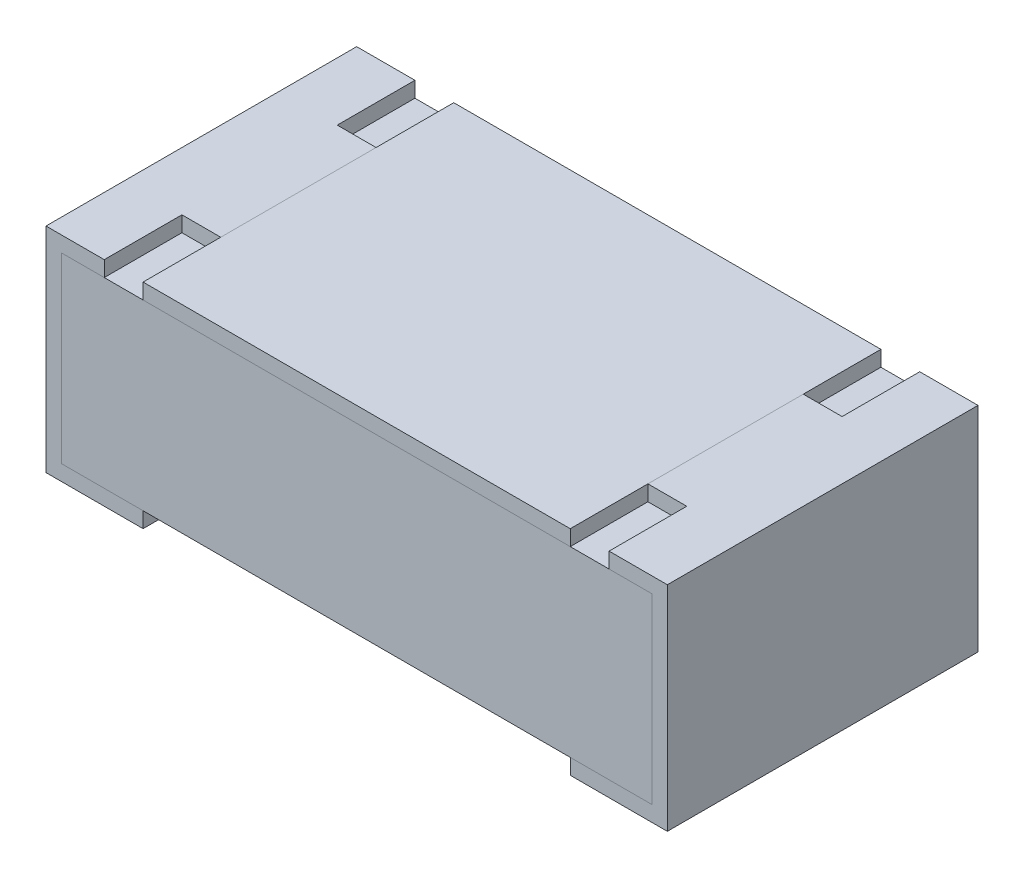
ISO-10303-21;
HEADER;
FILE_DESCRIPTION(('STEP AP214'),'2;1');
FILE_NAME('part.step','',(''),(''),'','','');
FILE_SCHEMA(('AUTOMOTIVE_DESIGN { 1 0 10303 214 1 1 1 1 }'));
ENDSEC;
DATA;
#1=APPLICATION_CONTEXT('core data for automotive mechanical design processes');
#2=APPLICATION_PROTOCOL_DEFINITION('international standard','automotive_design',2000,#1);
#3=PRODUCT_CONTEXT('',#1,'mechanical');
#4=PRODUCT('Part','Part','',(#3));
#5=PRODUCT_RELATED_PRODUCT_CATEGORY('part','',(#4));
#6=PRODUCT_DEFINITION_FORMATION('','',#4);
#7=PRODUCT_DEFINITION_CONTEXT('part definition',#1,'design');
#8=PRODUCT_DEFINITION('design','',#6,#7);
#9=PRODUCT_DEFINITION_SHAPE('','',#8);
#10=(LENGTH_UNIT() NAMED_UNIT(*) SI_UNIT(.MILLI.,.METRE.));
#11=(NAMED_UNIT(*) PLANE_ANGLE_UNIT() SI_UNIT($,.RADIAN.));
#12=(NAMED_UNIT(*) SI_UNIT($,.STERADIAN.) SOLID_ANGLE_UNIT());
#13=UNCERTAINTY_MEASURE_WITH_UNIT(LENGTH_MEASURE(1.E-05),#10,'distance_accuracy_value','');
#14=(GEOMETRIC_REPRESENTATION_CONTEXT(3) GLOBAL_UNCERTAINTY_ASSIGNED_CONTEXT((#13)) GLOBAL_UNIT_ASSIGNED_CONTEXT((#10,
#11,#12)) REPRESENTATION_CONTEXT('',''));
#15=CARTESIAN_POINT('',(0.,0.,0.));
#16=DIRECTION('',(0.,0.,1.));
#17=DIRECTION('',(1.,0.,0.));
#18=AXIS2_PLACEMENT_3D('',#15,#16,#17);
#19=CARTESIAN_POINT('',(-0.55,0.51,0.2));
#20=DIRECTION('',(0.,0.,-1.));
#21=DIRECTION('',(0.,-1.,0.));
#22=AXIS2_PLACEMENT_3D('',#19,#20,#21);
#23=PLANE('',#22);
#24=DIRECTION('',(-1.,0.,0.));
#25=VECTOR('',#24,1.);
#26=CARTESIAN_POINT('',(-0.55,0.55,0.2));
#27=LINE('',#26,#25);
#28=CARTESIAN_POINT('',(-0.55,0.55,0.2));
#29=VERTEX_POINT('',#28);
#30=CARTESIAN_POINT('',(-0.65,0.55,0.2));
#31=VERTEX_POINT('',#30);
#32=EDGE_CURVE('P0_E220',#29,#31,#27,.T.);
#33=ORIENTED_EDGE('',*,*,#32,.T.);
#34=DIRECTION('',(0.,1.,0.));
#35=VECTOR('',#34,1.);
#36=CARTESIAN_POINT('',(-0.65,0.51,0.2));
#37=LINE('',#36,#35);
#38=CARTESIAN_POINT('',(-0.65,0.51,0.2));
#39=VERTEX_POINT('',#38);
#40=EDGE_CURVE('P0_E11',#39,#31,#37,.T.);
#41=ORIENTED_EDGE('',*,*,#40,.F.);
#42=DIRECTION('',(-1.,0.,0.));
#43=VECTOR('',#42,1.);
#44=CARTESIAN_POINT('',(-0.55,0.51,0.2));
#45=LINE('',#44,#43);
#46=CARTESIAN_POINT('',(-0.55,0.51,0.2));
#47=VERTEX_POINT('',#46);
#48=EDGE_CURVE('P0_E142',#47,#39,#45,.T.);
#49=ORIENTED_EDGE('',*,*,#48,.F.);
#50=DIRECTION('',(0.,1.,0.));
#51=VECTOR('',#50,1.);
#52=CARTESIAN_POINT('',(-0.55,0.51,0.2));
#53=LINE('',#52,#51);
#54=EDGE_CURVE('P0_E209',#47,#29,#53,.T.);
#55=ORIENTED_EDGE('',*,*,#54,.T.);
#56=EDGE_LOOP('',(#33,#41,#49,#55));
#57=FACE_BOUND('',#56,.T.);
#58=ADVANCED_FACE('P0_F16',(#57),#23,.F.);
#59=CARTESIAN_POINT('',(-0.65,0.51,0.4));
#60=DIRECTION('',(-1.,0.,0.));
#61=DIRECTION('',(0.,0.,1.));
#62=AXIS2_PLACEMENT_3D('',#59,#60,#61);
#63=PLANE('',#62);
#64=DIRECTION('',(0.,0.,1.));
#65=VECTOR('',#64,1.);
#66=CARTESIAN_POINT('',(-0.65,0.55,0.4));
#67=LINE('',#66,#65);
#68=CARTESIAN_POINT('',(-0.65,0.55,0.4));
#69=VERTEX_POINT('',#68);
#70=EDGE_CURVE('P0_E152',#31,#69,#67,.T.);
#71=ORIENTED_EDGE('',*,*,#70,.T.);
#72=DIRECTION('',(0.,1.,0.));
#73=VECTOR('',#72,1.);
#74=CARTESIAN_POINT('',(-0.65,0.51,0.4));
#75=LINE('',#74,#73);
#76=CARTESIAN_POINT('',(-0.65,0.51,0.4));
#77=VERTEX_POINT('',#76);
#78=EDGE_CURVE('P0_E175',#77,#69,#75,.T.);
#79=ORIENTED_EDGE('',*,*,#78,.F.);
#80=DIRECTION('',(0.,0.,1.));
#81=VECTOR('',#80,1.);
#82=CARTESIAN_POINT('',(-0.65,0.51,0.4));
#83=LINE('',#82,#81);
#84=EDGE_CURVE('P0_E246',#39,#77,#83,.T.);
#85=ORIENTED_EDGE('',*,*,#84,.F.);
#86=ORIENTED_EDGE('',*,*,#40,.T.);
#87=EDGE_LOOP('',(#71,#79,#85,#86));
#88=FACE_BOUND('',#87,.T.);
#89=ADVANCED_FACE('P0_F363',(#88),#63,.F.);
#90=CARTESIAN_POINT('',(-0.65,0.51,-0.4));
#91=DIRECTION('',(-1.,0.,0.));
#92=DIRECTION('',(0.,0.,1.));
#93=AXIS2_PLACEMENT_3D('',#90,#91,#92);
#94=PLANE('',#93);
#95=DIRECTION('',(0.,0.,1.));
#96=VECTOR('',#95,1.);
#97=CARTESIAN_POINT('',(-0.65,0.55,-0.4));
#98=LINE('',#97,#96);
#99=CARTESIAN_POINT('',(-0.65,0.55,-0.4));
#100=VERTEX_POINT('',#99);
#101=CARTESIAN_POINT('',(-0.65,0.55,-0.2));
#102=VERTEX_POINT('',#101);
#103=EDGE_CURVE('P0_E194',#100,#102,#98,.T.);
#104=ORIENTED_EDGE('',*,*,#103,.T.);
#105=DIRECTION('',(0.,1.,0.));
#106=VECTOR('',#105,1.);
#107=CARTESIAN_POINT('',(-0.65,0.51,-0.2));
#108=LINE('',#107,#106);
#109=CARTESIAN_POINT('',(-0.65,0.51,-0.2));
#110=VERTEX_POINT('',#109);
#111=EDGE_CURVE('P0_E27',#110,#102,#108,.T.);
#112=ORIENTED_EDGE('',*,*,#111,.F.);
#113=DIRECTION('',(0.,0.,1.));
#114=VECTOR('',#113,1.);
#115=CARTESIAN_POINT('',(-0.65,0.51,-0.4));
#116=LINE('',#115,#114);
#117=CARTESIAN_POINT('',(-0.65,0.51,-0.4));
#118=VERTEX_POINT('',#117);
#119=EDGE_CURVE('P0_E255',#118,#110,#116,.T.);
#120=ORIENTED_EDGE('',*,*,#119,.F.);
#121=DIRECTION('',(0.,1.,0.));
#122=VECTOR('',#121,1.);
#123=CARTESIAN_POINT('',(-0.65,0.51,-0.4));
#124=LINE('',#123,#122);
#125=EDGE_CURVE('P0_E173',#118,#100,#124,.T.);
#126=ORIENTED_EDGE('',*,*,#125,.T.);
#127=EDGE_LOOP('',(#104,#112,#120,#126));
#128=FACE_BOUND('',#127,.T.);
#129=ADVANCED_FACE('P0_F395',(#128),#94,.F.);
#130=CARTESIAN_POINT('',(-0.55,0.51,-0.2));
#131=DIRECTION('',(0.,0.,1.));
#132=DIRECTION('',(1.,0.,0.));
#133=AXIS2_PLACEMENT_3D('',#130,#131,#132);
#134=PLANE('',#133);
#135=DIRECTION('',(1.,0.,0.));
#136=VECTOR('',#135,1.);
#137=CARTESIAN_POINT('',(-0.55,0.55,-0.2));
#138=LINE('',#137,#136);
#139=CARTESIAN_POINT('',(-0.55,0.55,-0.2));
#140=VERTEX_POINT('',#139);
#141=EDGE_CURVE('P0_E191',#102,#140,#138,.T.);
#142=ORIENTED_EDGE('',*,*,#141,.T.);
#143=DIRECTION('',(0.,1.,0.));
#144=VECTOR('',#143,1.);
#145=CARTESIAN_POINT('',(-0.55,0.51,-0.2));
#146=LINE('',#145,#144);
#147=CARTESIAN_POINT('',(-0.55,0.51,-0.2));
#148=VERTEX_POINT('',#147);
#149=EDGE_CURVE('P0_E249',#148,#140,#146,.T.);
#150=ORIENTED_EDGE('',*,*,#149,.F.);
#151=DIRECTION('',(1.,0.,0.));
#152=VECTOR('',#151,1.);
#153=CARTESIAN_POINT('',(-0.55,0.51,-0.2));
#154=LINE('',#153,#152);
#155=EDGE_CURVE('P0_E216',#110,#148,#154,.T.);
#156=ORIENTED_EDGE('',*,*,#155,.F.);
#157=ORIENTED_EDGE('',*,*,#111,.T.);
#158=EDGE_LOOP('',(#142,#150,#156,#157));
#159=FACE_BOUND('',#158,.T.);
#160=ADVANCED_FACE('P0_F374',(#159),#134,.F.);
#161=CARTESIAN_POINT('',(-0.76,0.04,0.4));
#162=DIRECTION('',(0.,1.,0.));
#163=DIRECTION('',(1.,0.,0.));
#164=AXIS2_PLACEMENT_3D('',#161,#162,#163);
#165=PLANE('',#164);
#166=DIRECTION('',(0.,0.,1.));
#167=VECTOR('',#166,1.);
#168=CARTESIAN_POINT('',(-0.55,0.04,0.4));
#169=LINE('',#168,#167);
#170=CARTESIAN_POINT('',(-0.55,0.04,-0.4));
#171=VERTEX_POINT('',#170);
#172=CARTESIAN_POINT('',(-0.55,0.04,0.4));
#173=VERTEX_POINT('',#172);
#174=EDGE_CURVE('P0_E227',#171,#173,#169,.T.);
#175=ORIENTED_EDGE('',*,*,#174,.F.);
#176=DIRECTION('',(-1.,0.,0.));
#177=VECTOR('',#176,1.);
#178=CARTESIAN_POINT('',(-0.8,0.04,-0.4));
#179=LINE('',#178,#177);
#180=CARTESIAN_POINT('',(-0.76,0.04,-0.4));
#181=VERTEX_POINT('',#180);
#182=EDGE_CURVE('P0_E137',#171,#181,#179,.T.);
#183=ORIENTED_EDGE('',*,*,#182,.T.);
#184=DIRECTION('',(0.,0.,-1.));
#185=VECTOR('',#184,1.);
#186=CARTESIAN_POINT('',(-0.76,0.04,0.4));
#187=LINE('',#186,#185);
#188=CARTESIAN_POINT('',(-0.76,0.04,0.4));
#189=VERTEX_POINT('',#188);
#190=EDGE_CURVE('P0_E130',#189,#181,#187,.T.);
#191=ORIENTED_EDGE('',*,*,#190,.F.);
#192=DIRECTION('',(1.,0.,0.));
#193=VECTOR('',#192,1.);
#194=CARTESIAN_POINT('',(-0.8,0.04,0.4));
#195=LINE('',#194,#193);
#196=EDGE_CURVE('P0_E135',#189,#173,#195,.T.);
#197=ORIENTED_EDGE('',*,*,#196,.T.);
#198=EDGE_LOOP('',(#175,#183,#191,#197));
#199=FACE_BOUND('',#198,.T.);
#200=ADVANCED_FACE('P0_F133',(#199),#165,.T.);
#201=CARTESIAN_POINT('',(-0.76,0.51,0.4));
#202=DIRECTION('',(1.,0.,0.));
#203=DIRECTION('',(0.,1.,0.));
#204=AXIS2_PLACEMENT_3D('',#201,#202,#203);
#205=PLANE('',#204);
#206=DIRECTION('',(0.,1.,0.));
#207=VECTOR('',#206,1.);
#208=CARTESIAN_POINT('',(-0.76,0.55,-0.4));
#209=LINE('',#208,#207);
#210=CARTESIAN_POINT('',(-0.76,0.51,-0.4));
#211=VERTEX_POINT('',#210);
#212=EDGE_CURVE('P0_E187',#181,#211,#209,.T.);
#213=ORIENTED_EDGE('',*,*,#212,.T.);
#214=DIRECTION('',(0.,0.,-1.));
#215=VECTOR('',#214,1.);
#216=CARTESIAN_POINT('',(-0.76,0.51,0.4));
#217=LINE('',#216,#215);
#218=CARTESIAN_POINT('',(-0.76,0.51,0.4));
#219=VERTEX_POINT('',#218);
#220=EDGE_CURVE('P0_E147',#219,#211,#217,.T.);
#221=ORIENTED_EDGE('',*,*,#220,.F.);
#222=DIRECTION('',(0.,-1.,0.));
#223=VECTOR('',#222,1.);
#224=CARTESIAN_POINT('',(-0.76,0.55,0.4));
#225=LINE('',#224,#223);
#226=EDGE_CURVE('P0_E145',#219,#189,#225,.T.);
#227=ORIENTED_EDGE('',*,*,#226,.T.);
#228=ORIENTED_EDGE('',*,*,#190,.T.);
#229=EDGE_LOOP('',(#213,#221,#227,#228));
#230=FACE_BOUND('',#229,.T.);
#231=ADVANCED_FACE('P0_F146',(#230),#205,.T.);
#232=CARTESIAN_POINT('',(0.76,0.51,0.4));
#233=DIRECTION('',(0.,-1.,0.));
#234=DIRECTION('',(0.,0.,-1.));
#235=AXIS2_PLACEMENT_3D('',#232,#233,#234);
#236=PLANE('',#235);
#237=ORIENTED_EDGE('',*,*,#84,.T.);
#238=DIRECTION('',(-1.,0.,0.));
#239=VECTOR('',#238,1.);
#240=CARTESIAN_POINT('',(-0.8,0.51,0.4));
#241=LINE('',#240,#239);
#242=EDGE_CURVE('P0_E179',#77,#219,#241,.T.);
#243=ORIENTED_EDGE('',*,*,#242,.T.);
#244=ORIENTED_EDGE('',*,*,#220,.T.);
#245=DIRECTION('',(1.,0.,0.));
#246=VECTOR('',#245,1.);
#247=CARTESIAN_POINT('',(-0.8,0.51,-0.4));
#248=LINE('',#247,#246);
#249=EDGE_CURVE('P0_E183',#211,#118,#248,.T.);
#250=ORIENTED_EDGE('',*,*,#249,.T.);
#251=ORIENTED_EDGE('',*,*,#119,.T.);
#252=ORIENTED_EDGE('',*,*,#155,.T.);
#253=DIRECTION('',(0.,0.,1.));
#254=VECTOR('',#253,1.);
#255=CARTESIAN_POINT('',(-0.55,0.51,0.4));
#256=LINE('',#255,#254);
#257=EDGE_CURVE('P0_E212',#148,#47,#256,.T.);
#258=ORIENTED_EDGE('',*,*,#257,.T.);
#259=ORIENTED_EDGE('',*,*,#48,.T.);
#260=EDGE_LOOP('',(#237,#243,#244,#250,#251,#252,#258,#259));
#261=FACE_BOUND('',#260,.T.);
#262=ADVANCED_FACE('P0_F381',(#261),#236,.T.);
#263=CARTESIAN_POINT('',(-0.55,0.55,0.4));
#264=DIRECTION('',(1.,0.,0.));
#265=DIRECTION('',(0.,1.,0.));
#266=AXIS2_PLACEMENT_3D('',#263,#264,#265);
#267=PLANE('',#266);
#268=ORIENTED_EDGE('',*,*,#54,.F.);
#269=ORIENTED_EDGE('',*,*,#257,.F.);
#270=ORIENTED_EDGE('',*,*,#149,.T.);
#271=DIRECTION('',(0.,0.,1.));
#272=VECTOR('',#271,1.);
#273=CARTESIAN_POINT('',(-0.55,0.55,0.));
#274=LINE('',#273,#272);
#275=EDGE_CURVE('P0_E195',#140,#29,#274,.T.);
#276=ORIENTED_EDGE('',*,*,#275,.T.);
#277=EDGE_LOOP('',(#268,#269,#270,#276));
#278=FACE_BOUND('',#277,.T.);
#279=ADVANCED_FACE('P0_F385',(#278),#267,.T.);
#280=CARTESIAN_POINT('',(0.,0.55,0.));
#281=DIRECTION('',(0.,-1.,0.));
#282=DIRECTION('',(0.,0.,-1.));
#283=AXIS2_PLACEMENT_3D('',#280,#281,#282);
#284=PLANE('',#283);
#285=DIRECTION('',(1.,0.,0.));
#286=VECTOR('',#285,1.);
#287=CARTESIAN_POINT('',(-0.8,0.55,0.4));
#288=LINE('',#287,#286);
#289=CARTESIAN_POINT('',(-0.8,0.55,0.4));
#290=VERTEX_POINT('',#289);
#291=EDGE_CURVE('P0_E20',#290,#69,#288,.T.);
#292=ORIENTED_EDGE('',*,*,#291,.T.);
#293=ORIENTED_EDGE('',*,*,#70,.F.);
#294=ORIENTED_EDGE('',*,*,#32,.F.);
#295=ORIENTED_EDGE('',*,*,#275,.F.);
#296=ORIENTED_EDGE('',*,*,#141,.F.);
#297=ORIENTED_EDGE('',*,*,#103,.F.);
#298=DIRECTION('',(-1.,0.,0.));
#299=VECTOR('',#298,1.);
#300=CARTESIAN_POINT('',(-0.8,0.55,-0.4));
#301=LINE('',#300,#299);
#302=CARTESIAN_POINT('',(-0.8,0.55,-0.4));
#303=VERTEX_POINT('',#302);
#304=EDGE_CURVE('P0_E169',#100,#303,#301,.T.);
#305=ORIENTED_EDGE('',*,*,#304,.T.);
#306=DIRECTION('',(0.,0.,1.));
#307=VECTOR('',#306,1.);
#308=CARTESIAN_POINT('',(-0.8,0.55,0.4));
#309=LINE('',#308,#307);
#310=EDGE_CURVE('P0_E199',#303,#290,#309,.T.);
#311=ORIENTED_EDGE('',*,*,#310,.T.);
#312=EDGE_LOOP('',(#292,#293,#294,#295,#296,#297,#305,#311));
#313=FACE_BOUND('',#312,.T.);
#314=ADVANCED_FACE('P0_F281',(#313),#284,.F.);
#315=CARTESIAN_POINT('',(0.,0.,0.));
#316=DIRECTION('',(0.,-1.,0.));
#317=DIRECTION('',(0.,0.,-1.));
#318=AXIS2_PLACEMENT_3D('',#315,#316,#317);
#319=PLANE('',#318);
#320=DIRECTION('',(0.,0.,-1.));
#321=VECTOR('',#320,1.);
#322=CARTESIAN_POINT('',(-0.55,0.,0.));
#323=LINE('',#322,#321);
#324=CARTESIAN_POINT('',(-0.55,0.,0.4));
#325=VERTEX_POINT('',#324);
#326=CARTESIAN_POINT('',(-0.55,0.,-0.4));
#327=VERTEX_POINT('',#326);
#328=EDGE_CURVE('P0_E174',#325,#327,#323,.T.);
#329=ORIENTED_EDGE('',*,*,#328,.F.);
#330=DIRECTION('',(1.,0.,0.));
#331=VECTOR('',#330,1.);
#332=CARTESIAN_POINT('',(-0.8,0.,0.4));
#333=LINE('',#332,#331);
#334=CARTESIAN_POINT('',(-0.8,0.,0.4));
#335=VERTEX_POINT('',#334);
#336=EDGE_CURVE('P0_E159',#335,#325,#333,.T.);
#337=ORIENTED_EDGE('',*,*,#336,.F.);
#338=DIRECTION('',(0.,0.,1.));
#339=VECTOR('',#338,1.);
#340=CARTESIAN_POINT('',(-0.8,0.,0.4));
#341=LINE('',#340,#339);
#342=CARTESIAN_POINT('',(-0.8,0.,-0.4));
#343=VERTEX_POINT('',#342);
#344=EDGE_CURVE('P0_E204',#343,#335,#341,.T.);
#345=ORIENTED_EDGE('',*,*,#344,.F.);
#346=DIRECTION('',(-1.,0.,0.));
#347=VECTOR('',#346,1.);
#348=CARTESIAN_POINT('',(-0.8,0.,-0.4));
#349=LINE('',#348,#347);
#350=EDGE_CURVE('P0_E190',#327,#343,#349,.T.);
#351=ORIENTED_EDGE('',*,*,#350,.F.);
#352=EDGE_LOOP('',(#329,#337,#345,#351));
#353=FACE_BOUND('',#352,.T.);
#354=ADVANCED_FACE('P0_F418',(#353),#319,.T.);
#355=CARTESIAN_POINT('',(-0.8,0.55,0.4));
#356=DIRECTION('',(0.,0.,-1.));
#357=DIRECTION('',(0.,-1.,0.));
#358=AXIS2_PLACEMENT_3D('',#355,#356,#357);
#359=PLANE('',#358);
#360=ORIENTED_EDGE('',*,*,#242,.F.);
#361=ORIENTED_EDGE('',*,*,#78,.T.);
#362=ORIENTED_EDGE('',*,*,#291,.F.);
#363=DIRECTION('',(0.,-1.,0.));
#364=VECTOR('',#363,1.);
#365=CARTESIAN_POINT('',(-0.8,0.55,0.4));
#366=LINE('',#365,#364);
#367=EDGE_CURVE('P0_E208',#290,#335,#366,.T.);
#368=ORIENTED_EDGE('',*,*,#367,.T.);
#369=ORIENTED_EDGE('',*,*,#336,.T.);
#370=DIRECTION('',(0.,1.,0.));
#371=VECTOR('',#370,1.);
#372=CARTESIAN_POINT('',(-0.55,0.55,0.4));
#373=LINE('',#372,#371);
#374=EDGE_CURVE('P0_E156',#325,#173,#373,.T.);
#375=ORIENTED_EDGE('',*,*,#374,.T.);
#376=ORIENTED_EDGE('',*,*,#196,.F.);
#377=ORIENTED_EDGE('',*,*,#226,.F.);
#378=EDGE_LOOP('',(#360,#361,#362,#368,#369,#375,#376,#377));
#379=FACE_BOUND('',#378,.T.);
#380=ADVANCED_FACE('P0_F154',(#379),#359,.F.);
#381=CARTESIAN_POINT('',(-0.8,0.55,0.4));
#382=DIRECTION('',(1.,0.,0.));
#383=DIRECTION('',(0.,1.,0.));
#384=AXIS2_PLACEMENT_3D('',#381,#382,#383);
#385=PLANE('',#384);
#386=ORIENTED_EDGE('',*,*,#344,.T.);
#387=ORIENTED_EDGE('',*,*,#367,.F.);
#388=ORIENTED_EDGE('',*,*,#310,.F.);
#389=DIRECTION('',(0.,-1.,0.));
#390=VECTOR('',#389,1.);
#391=CARTESIAN_POINT('',(-0.8,0.55,-0.4));
#392=LINE('',#391,#390);
#393=EDGE_CURVE('P0_E203',#303,#343,#392,.T.);
#394=ORIENTED_EDGE('',*,*,#393,.T.);
#395=EDGE_LOOP('',(#386,#387,#388,#394));
#396=FACE_BOUND('',#395,.T.);
#397=ADVANCED_FACE('P0_F18',(#396),#385,.F.);
#398=CARTESIAN_POINT('',(-0.8,0.55,-0.4));
#399=DIRECTION('',(0.,0.,1.));
#400=DIRECTION('',(1.,0.,0.));
#401=AXIS2_PLACEMENT_3D('',#398,#399,#400);
#402=PLANE('',#401);
#403=ORIENTED_EDGE('',*,*,#304,.F.);
#404=ORIENTED_EDGE('',*,*,#125,.F.);
#405=ORIENTED_EDGE('',*,*,#249,.F.);
#406=ORIENTED_EDGE('',*,*,#212,.F.);
#407=ORIENTED_EDGE('',*,*,#182,.F.);
#408=DIRECTION('',(0.,-1.,0.));
#409=VECTOR('',#408,1.);
#410=CARTESIAN_POINT('',(-0.55,0.55,-0.4));
#411=LINE('',#410,#409);
#412=EDGE_CURVE('P0_E231',#171,#327,#411,.T.);
#413=ORIENTED_EDGE('',*,*,#412,.T.);
#414=ORIENTED_EDGE('',*,*,#350,.T.);
#415=ORIENTED_EDGE('',*,*,#393,.F.);
#416=EDGE_LOOP('',(#403,#404,#405,#406,#407,#413,#414,#415));
#417=FACE_BOUND('',#416,.T.);
#418=ADVANCED_FACE('P0_F403',(#417),#402,.F.);
#419=CARTESIAN_POINT('',(-0.55,0.,0.4));
#420=DIRECTION('',(-1.,0.,0.));
#421=DIRECTION('',(0.,0.,1.));
#422=AXIS2_PLACEMENT_3D('',#419,#420,#421);
#423=PLANE('',#422);
#424=ORIENTED_EDGE('',*,*,#412,.F.);
#425=ORIENTED_EDGE('',*,*,#174,.T.);
#426=ORIENTED_EDGE('',*,*,#374,.F.);
#427=ORIENTED_EDGE('',*,*,#328,.T.);
#428=EDGE_LOOP('',(#424,#425,#426,#427));
#429=FACE_BOUND('',#428,.T.);
#430=ADVANCED_FACE('P0_F407',(#429),#423,.F.);
#431=CLOSED_SHELL('',(#58,#89,#129,#160,#200,#231,#262,#279,#314,#354,#380,#397,#418,#430));
#432=MANIFOLD_SOLID_BREP('P0_B1',#431);
#433=CARTESIAN_POINT('',(-0.8,0.55,0.4));
#434=DIRECTION('',(0.,0.,-1.));
#435=DIRECTION('',(0.,-1.,0.));
#436=AXIS2_PLACEMENT_3D('',#433,#434,#435);
#437=PLANE('',#436);
#438=DIRECTION('',(1.,0.,0.));
#439=VECTOR('',#438,1.);
#440=CARTESIAN_POINT('',(-0.8,0.04,0.4));
#441=LINE('',#440,#439);
#442=CARTESIAN_POINT('',(-0.76,0.04,0.4));
#443=VERTEX_POINT('',#442);
#444=CARTESIAN_POINT('',(0.76,0.04,0.4));
#445=VERTEX_POINT('',#444);
#446=EDGE_CURVE('P1_E96',#443,#445,#441,.T.);
#447=ORIENTED_EDGE('',*,*,#446,.T.);
#448=DIRECTION('',(0.,1.,0.));
#449=VECTOR('',#448,1.);
#450=CARTESIAN_POINT('',(0.76,0.55,0.4));
#451=LINE('',#450,#449);
#452=CARTESIAN_POINT('',(0.76,0.51,0.4));
#453=VERTEX_POINT('',#452);
#454=EDGE_CURVE('P1_E11',#445,#453,#451,.T.);
#455=ORIENTED_EDGE('',*,*,#454,.T.);
#456=DIRECTION('',(-1.,0.,0.));
#457=VECTOR('',#456,1.);
#458=CARTESIAN_POINT('',(-0.8,0.51,0.4));
#459=LINE('',#458,#457);
#460=CARTESIAN_POINT('',(-0.76,0.51,0.4));
#461=VERTEX_POINT('',#460);
#462=EDGE_CURVE('P1_E120',#453,#461,#459,.T.);
#463=ORIENTED_EDGE('',*,*,#462,.T.);
#464=DIRECTION('',(0.,-1.,0.));
#465=VECTOR('',#464,1.);
#466=CARTESIAN_POINT('',(-0.76,0.55,0.4));
#467=LINE('',#466,#465);
#468=EDGE_CURVE('P1_E76',#461,#443,#467,.T.);
#469=ORIENTED_EDGE('',*,*,#468,.T.);
#470=EDGE_LOOP('',(#447,#455,#463,#469));
#471=FACE_BOUND('',#470,.T.);
#472=ADVANCED_FACE('P1_F17',(#471),#437,.F.);
#473=CARTESIAN_POINT('',(-0.8,0.55,-0.4));
#474=DIRECTION('',(0.,0.,1.));
#475=DIRECTION('',(1.,0.,0.));
#476=AXIS2_PLACEMENT_3D('',#473,#474,#475);
#477=PLANE('',#476);
#478=DIRECTION('',(0.,-1.,0.));
#479=VECTOR('',#478,1.);
#480=CARTESIAN_POINT('',(0.76,0.55,-0.4));
#481=LINE('',#480,#479);
#482=CARTESIAN_POINT('',(0.76,0.51,-0.4));
#483=VERTEX_POINT('',#482);
#484=CARTESIAN_POINT('',(0.76,0.04,-0.4));
#485=VERTEX_POINT('',#484);
#486=EDGE_CURVE('P1_E21',#483,#485,#481,.T.);
#487=ORIENTED_EDGE('',*,*,#486,.T.);
#488=DIRECTION('',(-1.,0.,0.));
#489=VECTOR('',#488,1.);
#490=CARTESIAN_POINT('',(-0.8,0.04,-0.4));
#491=LINE('',#490,#489);
#492=CARTESIAN_POINT('',(-0.76,0.04,-0.4));
#493=VERTEX_POINT('',#492);
#494=EDGE_CURVE('P1_E86',#485,#493,#491,.T.);
#495=ORIENTED_EDGE('',*,*,#494,.T.);
#496=DIRECTION('',(0.,1.,0.));
#497=VECTOR('',#496,1.);
#498=CARTESIAN_POINT('',(-0.76,0.55,-0.4));
#499=LINE('',#498,#497);
#500=CARTESIAN_POINT('',(-0.76,0.51,-0.4));
#501=VERTEX_POINT('',#500);
#502=EDGE_CURVE('P1_E70',#493,#501,#499,.T.);
#503=ORIENTED_EDGE('',*,*,#502,.T.);
#504=DIRECTION('',(1.,0.,0.));
#505=VECTOR('',#504,1.);
#506=CARTESIAN_POINT('',(-0.8,0.51,-0.4));
#507=LINE('',#506,#505);
#508=EDGE_CURVE('P1_E88',#501,#483,#507,.T.);
#509=ORIENTED_EDGE('',*,*,#508,.T.);
#510=EDGE_LOOP('',(#487,#495,#503,#509));
#511=FACE_BOUND('',#510,.T.);
#512=ADVANCED_FACE('P1_F19',(#511),#477,.F.);
#513=CARTESIAN_POINT('',(0.76,0.51,0.4));
#514=DIRECTION('',(-1.,0.,0.));
#515=DIRECTION('',(0.,0.,1.));
#516=AXIS2_PLACEMENT_3D('',#513,#514,#515);
#517=PLANE('',#516);
#518=ORIENTED_EDGE('',*,*,#486,.F.);
#519=DIRECTION('',(0.,0.,-1.));
#520=VECTOR('',#519,1.);
#521=CARTESIAN_POINT('',(0.76,0.51,0.4));
#522=LINE('',#521,#520);
#523=EDGE_CURVE('P1_E107',#453,#483,#522,.T.);
#524=ORIENTED_EDGE('',*,*,#523,.F.);
#525=ORIENTED_EDGE('',*,*,#454,.F.);
#526=DIRECTION('',(0.,0.,-1.));
#527=VECTOR('',#526,1.);
#528=CARTESIAN_POINT('',(0.76,0.04,0.4));
#529=LINE('',#528,#527);
#530=EDGE_CURVE('P1_E91',#445,#485,#529,.T.);
#531=ORIENTED_EDGE('',*,*,#530,.T.);
#532=EDGE_LOOP('',(#518,#524,#525,#531));
#533=FACE_BOUND('',#532,.T.);
#534=ADVANCED_FACE('P1_F92',(#533),#517,.F.);
#535=CARTESIAN_POINT('',(-0.76,0.51,0.4));
#536=DIRECTION('',(1.,0.,0.));
#537=DIRECTION('',(0.,1.,0.));
#538=AXIS2_PLACEMENT_3D('',#535,#536,#537);
#539=PLANE('',#538);
#540=ORIENTED_EDGE('',*,*,#502,.F.);
#541=DIRECTION('',(0.,0.,-1.));
#542=VECTOR('',#541,1.);
#543=CARTESIAN_POINT('',(-0.76,0.04,0.4));
#544=LINE('',#543,#542);
#545=EDGE_CURVE('P1_E99',#443,#493,#544,.T.);
#546=ORIENTED_EDGE('',*,*,#545,.F.);
#547=ORIENTED_EDGE('',*,*,#468,.F.);
#548=DIRECTION('',(0.,0.,-1.));
#549=VECTOR('',#548,1.);
#550=CARTESIAN_POINT('',(-0.76,0.51,0.4));
#551=LINE('',#550,#549);
#552=EDGE_CURVE('P1_E115',#461,#501,#551,.T.);
#553=ORIENTED_EDGE('',*,*,#552,.T.);
#554=EDGE_LOOP('',(#540,#546,#547,#553));
#555=FACE_BOUND('',#554,.T.);
#556=ADVANCED_FACE('P1_F141',(#555),#539,.F.);
#557=CARTESIAN_POINT('',(0.76,0.51,0.4));
#558=DIRECTION('',(0.,-1.,0.));
#559=DIRECTION('',(0.,0.,-1.));
#560=AXIS2_PLACEMENT_3D('',#557,#558,#559);
#561=PLANE('',#560);
#562=ORIENTED_EDGE('',*,*,#508,.F.);
#563=ORIENTED_EDGE('',*,*,#552,.F.);
#564=ORIENTED_EDGE('',*,*,#462,.F.);
#565=ORIENTED_EDGE('',*,*,#523,.T.);
#566=EDGE_LOOP('',(#562,#563,#564,#565));
#567=FACE_BOUND('',#566,.T.);
#568=ADVANCED_FACE('P1_F139',(#567),#561,.F.);
#569=CARTESIAN_POINT('',(-0.76,0.04,0.4));
#570=DIRECTION('',(0.,1.,0.));
#571=DIRECTION('',(1.,0.,0.));
#572=AXIS2_PLACEMENT_3D('',#569,#570,#571);
#573=PLANE('',#572);
#574=ORIENTED_EDGE('',*,*,#494,.F.);
#575=ORIENTED_EDGE('',*,*,#530,.F.);
#576=ORIENTED_EDGE('',*,*,#446,.F.);
#577=ORIENTED_EDGE('',*,*,#545,.T.);
#578=EDGE_LOOP('',(#574,#575,#576,#577));
#579=FACE_BOUND('',#578,.T.);
#580=ADVANCED_FACE('P1_F98',(#579),#573,.F.);
#581=CLOSED_SHELL('',(#472,#512,#534,#556,#568,#580));
#582=MANIFOLD_SOLID_BREP('P1_B1',#581);
#583=CARTESIAN_POINT('',(0.65,0.51,0.4));
#584=DIRECTION('',(1.,0.,0.));
#585=DIRECTION('',(0.,0.,-1.));
#586=AXIS2_PLACEMENT_3D('',#583,#584,#585);
#587=PLANE('',#586);
#588=DIRECTION('',(0.,0.,-1.));
#589=VECTOR('',#588,1.);
#590=CARTESIAN_POINT('',(0.65,0.55,0.4));
#591=LINE('',#590,#589);
#592=CARTESIAN_POINT('',(0.65,0.55,0.4));
#593=VERTEX_POINT('',#592);
#594=CARTESIAN_POINT('',(0.65,0.55,0.2));
#595=VERTEX_POINT('',#594);
#596=EDGE_CURVE('P2_E158',#593,#595,#591,.T.);
#597=ORIENTED_EDGE('',*,*,#596,.T.);
#598=DIRECTION('',(0.,1.,0.));
#599=VECTOR('',#598,1.);
#600=CARTESIAN_POINT('',(0.65,0.51,0.2));
#601=LINE('',#600,#599);
#602=CARTESIAN_POINT('',(0.65,0.51,0.2));
#603=VERTEX_POINT('',#602);
#604=EDGE_CURVE('P2_E11',#603,#595,#601,.T.);
#605=ORIENTED_EDGE('',*,*,#604,.F.);
#606=DIRECTION('',(0.,0.,-1.));
#607=VECTOR('',#606,1.);
#608=CARTESIAN_POINT('',(0.65,0.51,0.4));
#609=LINE('',#608,#607);
#610=CARTESIAN_POINT('',(0.65,0.51,0.4));
#611=VERTEX_POINT('',#610);
#612=EDGE_CURVE('P2_E138',#611,#603,#609,.T.);
#613=ORIENTED_EDGE('',*,*,#612,.F.);
#614=DIRECTION('',(0.,1.,0.));
#615=VECTOR('',#614,1.);
#616=CARTESIAN_POINT('',(0.65,0.51,0.4));
#617=LINE('',#616,#615);
#618=EDGE_CURVE('P2_E121',#611,#593,#617,.T.);
#619=ORIENTED_EDGE('',*,*,#618,.T.);
#620=EDGE_LOOP('',(#597,#605,#613,#619));
#621=FACE_BOUND('',#620,.T.);
#622=ADVANCED_FACE('P2_F16',(#621),#587,.F.);
#623=CARTESIAN_POINT('',(0.55,0.51,0.2));
#624=DIRECTION('',(0.,0.,-1.));
#625=DIRECTION('',(-1.,0.,0.));
#626=AXIS2_PLACEMENT_3D('',#623,#624,#625);
#627=PLANE('',#626);
#628=DIRECTION('',(-1.,0.,0.));
#629=VECTOR('',#628,1.);
#630=CARTESIAN_POINT('',(0.55,0.55,0.2));
#631=LINE('',#630,#629);
#632=CARTESIAN_POINT('',(0.55,0.55,0.2));
#633=VERTEX_POINT('',#632);
#634=EDGE_CURVE('P2_E142',#595,#633,#631,.T.);
#635=ORIENTED_EDGE('',*,*,#634,.T.);
#636=DIRECTION('',(0.,1.,0.));
#637=VECTOR('',#636,1.);
#638=CARTESIAN_POINT('',(0.55,0.51,0.2));
#639=LINE('',#638,#637);
#640=CARTESIAN_POINT('',(0.55,0.51,0.2));
#641=VERTEX_POINT('',#640);
#642=EDGE_CURVE('P2_E219',#641,#633,#639,.T.);
#643=ORIENTED_EDGE('',*,*,#642,.F.);
#644=DIRECTION('',(-1.,0.,0.));
#645=VECTOR('',#644,1.);
#646=CARTESIAN_POINT('',(0.55,0.51,0.2));
#647=LINE('',#646,#645);
#648=EDGE_CURVE('P2_E199',#603,#641,#647,.T.);
#649=ORIENTED_EDGE('',*,*,#648,.F.);
#650=ORIENTED_EDGE('',*,*,#604,.T.);
#651=EDGE_LOOP('',(#635,#643,#649,#650));
#652=FACE_BOUND('',#651,.T.);
#653=ADVANCED_FACE('P2_F319',(#652),#627,.F.);
#654=CARTESIAN_POINT('',(0.55,0.51,-0.2));
#655=DIRECTION('',(0.,0.,1.));
#656=DIRECTION('',(1.,0.,0.));
#657=AXIS2_PLACEMENT_3D('',#654,#655,#656);
#658=PLANE('',#657);
#659=DIRECTION('',(1.,0.,0.));
#660=VECTOR('',#659,1.);
#661=CARTESIAN_POINT('',(0.55,0.55,-0.2));
#662=LINE('',#661,#660);
#663=CARTESIAN_POINT('',(0.55,0.55,-0.2));
#664=VERTEX_POINT('',#663);
#665=CARTESIAN_POINT('',(0.65,0.55,-0.2));
#666=VERTEX_POINT('',#665);
#667=EDGE_CURVE('P2_E215',#664,#666,#662,.T.);
#668=ORIENTED_EDGE('',*,*,#667,.T.);
#669=DIRECTION('',(0.,1.,0.));
#670=VECTOR('',#669,1.);
#671=CARTESIAN_POINT('',(0.65,0.51,-0.2));
#672=LINE('',#671,#670);
#673=CARTESIAN_POINT('',(0.65,0.51,-0.2));
#674=VERTEX_POINT('',#673);
#675=EDGE_CURVE('P2_E27',#674,#666,#672,.T.);
#676=ORIENTED_EDGE('',*,*,#675,.F.);
#677=DIRECTION('',(1.,0.,0.));
#678=VECTOR('',#677,1.);
#679=CARTESIAN_POINT('',(0.55,0.51,-0.2));
#680=LINE('',#679,#678);
#681=CARTESIAN_POINT('',(0.55,0.51,-0.2));
#682=VERTEX_POINT('',#681);
#683=EDGE_CURVE('P2_E200',#682,#674,#680,.T.);
#684=ORIENTED_EDGE('',*,*,#683,.F.);
#685=DIRECTION('',(0.,1.,0.));
#686=VECTOR('',#685,1.);
#687=CARTESIAN_POINT('',(0.55,0.51,-0.2));
#688=LINE('',#687,#686);
#689=EDGE_CURVE('P2_E160',#682,#664,#688,.T.);
#690=ORIENTED_EDGE('',*,*,#689,.T.);
#691=EDGE_LOOP('',(#668,#676,#684,#690));
#692=FACE_BOUND('',#691,.T.);
#693=ADVANCED_FACE('P2_F323',(#692),#658,.F.);
#694=CARTESIAN_POINT('',(0.65,0.51,-0.4));
#695=DIRECTION('',(1.,0.,0.));
#696=DIRECTION('',(0.,0.,-1.));
#697=AXIS2_PLACEMENT_3D('',#694,#695,#696);
#698=PLANE('',#697);
#699=DIRECTION('',(0.,0.,-1.));
#700=VECTOR('',#699,1.);
#701=CARTESIAN_POINT('',(0.65,0.55,-0.4));
#702=LINE('',#701,#700);
#703=CARTESIAN_POINT('',(0.65,0.55,-0.4));
#704=VERTEX_POINT('',#703);
#705=EDGE_CURVE('P2_E275',#666,#704,#702,.T.);
#706=ORIENTED_EDGE('',*,*,#705,.T.);
#707=DIRECTION('',(0.,1.,0.));
#708=VECTOR('',#707,1.);
#709=CARTESIAN_POINT('',(0.65,0.51,-0.4));
#710=LINE('',#709,#708);
#711=CARTESIAN_POINT('',(0.65,0.51,-0.4));
#712=VERTEX_POINT('',#711);
#713=EDGE_CURVE('P2_E231',#712,#704,#710,.T.);
#714=ORIENTED_EDGE('',*,*,#713,.F.);
#715=DIRECTION('',(0.,0.,-1.));
#716=VECTOR('',#715,1.);
#717=CARTESIAN_POINT('',(0.65,0.51,-0.4));
#718=LINE('',#717,#716);
#719=EDGE_CURVE('P2_E155',#674,#712,#718,.T.);
#720=ORIENTED_EDGE('',*,*,#719,.F.);
#721=ORIENTED_EDGE('',*,*,#675,.T.);
#722=EDGE_LOOP('',(#706,#714,#720,#721));
#723=FACE_BOUND('',#722,.T.);
#724=ADVANCED_FACE('P2_F328',(#723),#698,.F.);
#725=CARTESIAN_POINT('',(0.8,0.55,0.4));
#726=DIRECTION('',(-1.,0.,0.));
#727=DIRECTION('',(0.,0.,1.));
#728=AXIS2_PLACEMENT_3D('',#725,#726,#727);
#729=PLANE('',#728);
#730=DIRECTION('',(0.,0.,-1.));
#731=VECTOR('',#730,1.);
#732=CARTESIAN_POINT('',(0.8,0.,0.4));
#733=LINE('',#732,#731);
#734=CARTESIAN_POINT('',(0.8,0.,0.4));
#735=VERTEX_POINT('',#734);
#736=CARTESIAN_POINT('',(0.8,0.,-0.4));
#737=VERTEX_POINT('',#736);
#738=EDGE_CURVE('P2_E134',#735,#737,#733,.T.);
#739=ORIENTED_EDGE('',*,*,#738,.T.);
#740=DIRECTION('',(0.,-1.,0.));
#741=VECTOR('',#740,1.);
#742=CARTESIAN_POINT('',(0.8,0.55,-0.4));
#743=LINE('',#742,#741);
#744=CARTESIAN_POINT('',(0.8,0.55,-0.4));
#745=VERTEX_POINT('',#744);
#746=EDGE_CURVE('P2_E42',#745,#737,#743,.T.);
#747=ORIENTED_EDGE('',*,*,#746,.F.);
#748=DIRECTION('',(0.,0.,-1.));
#749=VECTOR('',#748,1.);
#750=CARTESIAN_POINT('',(0.8,0.55,0.4));
#751=LINE('',#750,#749);
#752=CARTESIAN_POINT('',(0.8,0.55,0.4));
#753=VERTEX_POINT('',#752);
#754=EDGE_CURVE('P2_E232',#753,#745,#751,.T.);
#755=ORIENTED_EDGE('',*,*,#754,.F.);
#756=DIRECTION('',(0.,-1.,0.));
#757=VECTOR('',#756,1.);
#758=CARTESIAN_POINT('',(0.8,0.55,0.4));
#759=LINE('',#758,#757);
#760=EDGE_CURVE('P2_E133',#753,#735,#759,.T.);
#761=ORIENTED_EDGE('',*,*,#760,.T.);
#762=EDGE_LOOP('',(#739,#747,#755,#761));
#763=FACE_BOUND('',#762,.T.);
#764=ADVANCED_FACE('P2_F265',(#763),#729,.F.);
#765=CARTESIAN_POINT('',(-0.8,0.55,-0.4));
#766=DIRECTION('',(0.,0.,1.));
#767=DIRECTION('',(1.,0.,0.));
#768=AXIS2_PLACEMENT_3D('',#765,#766,#767);
#769=PLANE('',#768);
#770=DIRECTION('',(1.,0.,0.));
#771=VECTOR('',#770,1.);
#772=CARTESIAN_POINT('',(-0.8,0.51,-0.4));
#773=LINE('',#772,#771);
#774=CARTESIAN_POINT('',(0.76,0.51,-0.4));
#775=VERTEX_POINT('',#774);
#776=EDGE_CURVE('P2_E149',#712,#775,#773,.T.);
#777=ORIENTED_EDGE('',*,*,#776,.F.);
#778=ORIENTED_EDGE('',*,*,#713,.T.);
#779=DIRECTION('',(-1.,0.,0.));
#780=VECTOR('',#779,1.);
#781=CARTESIAN_POINT('',(-0.8,0.55,-0.4));
#782=LINE('',#781,#780);
#783=EDGE_CURVE('P2_E20',#745,#704,#782,.T.);
#784=ORIENTED_EDGE('',*,*,#783,.F.);
#785=ORIENTED_EDGE('',*,*,#746,.T.);
#786=DIRECTION('',(-1.,0.,0.));
#787=VECTOR('',#786,1.);
#788=CARTESIAN_POINT('',(-0.8,0.,-0.4));
#789=LINE('',#788,#787);
#790=CARTESIAN_POINT('',(0.55,0.,-0.4));
#791=VERTEX_POINT('',#790);
#792=EDGE_CURVE('P2_E193',#737,#791,#789,.T.);
#793=ORIENTED_EDGE('',*,*,#792,.T.);
#794=DIRECTION('',(0.,-1.,0.));
#795=VECTOR('',#794,1.);
#796=CARTESIAN_POINT('',(0.55,0.55,-0.4));
#797=LINE('',#796,#795);
#798=CARTESIAN_POINT('',(0.55,0.04,-0.4));
#799=VERTEX_POINT('',#798);
#800=EDGE_CURVE('P2_E166',#799,#791,#797,.T.);
#801=ORIENTED_EDGE('',*,*,#800,.F.);
#802=DIRECTION('',(-1.,0.,0.));
#803=VECTOR('',#802,1.);
#804=CARTESIAN_POINT('',(-0.8,0.04,-0.4));
#805=LINE('',#804,#803);
#806=CARTESIAN_POINT('',(0.76,0.04,-0.4));
#807=VERTEX_POINT('',#806);
#808=EDGE_CURVE('P2_E164',#807,#799,#805,.T.);
#809=ORIENTED_EDGE('',*,*,#808,.F.);
#810=DIRECTION('',(0.,-1.,0.));
#811=VECTOR('',#810,1.);
#812=CARTESIAN_POINT('',(0.76,0.55,-0.4));
#813=LINE('',#812,#811);
#814=EDGE_CURVE('P2_E188',#775,#807,#813,.T.);
#815=ORIENTED_EDGE('',*,*,#814,.F.);
#816=EDGE_LOOP('',(#777,#778,#784,#785,#793,#801,#809,#815));
#817=FACE_BOUND('',#816,.T.);
#818=ADVANCED_FACE('P2_F271',(#817),#769,.F.);
#819=CARTESIAN_POINT('',(-0.8,0.55,0.4));
#820=DIRECTION('',(0.,0.,-1.));
#821=DIRECTION('',(0.,-1.,0.));
#822=AXIS2_PLACEMENT_3D('',#819,#820,#821);
#823=PLANE('',#822);
#824=DIRECTION('',(1.,0.,0.));
#825=VECTOR('',#824,1.);
#826=CARTESIAN_POINT('',(-0.8,0.55,0.4));
#827=LINE('',#826,#825);
#828=EDGE_CURVE('P2_E128',#593,#753,#827,.T.);
#829=ORIENTED_EDGE('',*,*,#828,.F.);
#830=ORIENTED_EDGE('',*,*,#618,.F.);
#831=DIRECTION('',(-1.,0.,0.));
#832=VECTOR('',#831,1.);
#833=CARTESIAN_POINT('',(-0.8,0.51,0.4));
#834=LINE('',#833,#832);
#835=CARTESIAN_POINT('',(0.76,0.51,0.4));
#836=VERTEX_POINT('',#835);
#837=EDGE_CURVE('P2_E125',#836,#611,#834,.T.);
#838=ORIENTED_EDGE('',*,*,#837,.F.);
#839=DIRECTION('',(0.,1.,0.));
#840=VECTOR('',#839,1.);
#841=CARTESIAN_POINT('',(0.76,0.55,0.4));
#842=LINE('',#841,#840);
#843=CARTESIAN_POINT('',(0.76,0.04,0.4));
#844=VERTEX_POINT('',#843);
#845=EDGE_CURVE('P2_E180',#844,#836,#842,.T.);
#846=ORIENTED_EDGE('',*,*,#845,.F.);
#847=DIRECTION('',(1.,0.,0.));
#848=VECTOR('',#847,1.);
#849=CARTESIAN_POINT('',(-0.8,0.04,0.4));
#850=LINE('',#849,#848);
#851=CARTESIAN_POINT('',(0.55,0.04,0.4));
#852=VERTEX_POINT('',#851);
#853=EDGE_CURVE('P2_E208',#852,#844,#850,.T.);
#854=ORIENTED_EDGE('',*,*,#853,.F.);
#855=DIRECTION('',(0.,1.,0.));
#856=VECTOR('',#855,1.);
#857=CARTESIAN_POINT('',(0.55,0.55,0.4));
#858=LINE('',#857,#856);
#859=CARTESIAN_POINT('',(0.55,0.,0.4));
#860=VERTEX_POINT('',#859);
#861=EDGE_CURVE('P2_E178',#860,#852,#858,.T.);
#862=ORIENTED_EDGE('',*,*,#861,.F.);
#863=DIRECTION('',(1.,0.,0.));
#864=VECTOR('',#863,1.);
#865=CARTESIAN_POINT('',(-0.8,0.,0.4));
#866=LINE('',#865,#864);
#867=EDGE_CURVE('P2_E195',#860,#735,#866,.T.);
#868=ORIENTED_EDGE('',*,*,#867,.T.);
#869=ORIENTED_EDGE('',*,*,#760,.F.);
#870=EDGE_LOOP('',(#829,#830,#838,#846,#854,#862,#868,#869));
#871=FACE_BOUND('',#870,.T.);
#872=ADVANCED_FACE('P2_F123',(#871),#823,.F.);
#873=CARTESIAN_POINT('',(0.,0.,0.));
#874=DIRECTION('',(0.,-1.,0.));
#875=DIRECTION('',(0.,0.,-1.));
#876=AXIS2_PLACEMENT_3D('',#873,#874,#875);
#877=PLANE('',#876);
#878=ORIENTED_EDGE('',*,*,#867,.F.);
#879=DIRECTION('',(0.,0.,-1.));
#880=VECTOR('',#879,1.);
#881=CARTESIAN_POINT('',(0.55,0.,0.));
#882=LINE('',#881,#880);
#883=EDGE_CURVE('P2_E169',#860,#791,#882,.T.);
#884=ORIENTED_EDGE('',*,*,#883,.T.);
#885=ORIENTED_EDGE('',*,*,#792,.F.);
#886=ORIENTED_EDGE('',*,*,#738,.F.);
#887=EDGE_LOOP('',(#878,#884,#885,#886));
#888=FACE_BOUND('',#887,.T.);
#889=ADVANCED_FACE('P2_F18',(#888),#877,.T.);
#890=CARTESIAN_POINT('',(0.,0.55,0.));
#891=DIRECTION('',(0.,-1.,0.));
#892=DIRECTION('',(0.,0.,-1.));
#893=AXIS2_PLACEMENT_3D('',#890,#891,#892);
#894=PLANE('',#893);
#895=DIRECTION('',(0.,0.,1.));
#896=VECTOR('',#895,1.);
#897=CARTESIAN_POINT('',(0.55,0.55,0.));
#898=LINE('',#897,#896);
#899=EDGE_CURVE('P2_E165',#664,#633,#898,.T.);
#900=ORIENTED_EDGE('',*,*,#899,.T.);
#901=ORIENTED_EDGE('',*,*,#634,.F.);
#902=ORIENTED_EDGE('',*,*,#596,.F.);
#903=ORIENTED_EDGE('',*,*,#828,.T.);
#904=ORIENTED_EDGE('',*,*,#754,.T.);
#905=ORIENTED_EDGE('',*,*,#783,.T.);
#906=ORIENTED_EDGE('',*,*,#705,.F.);
#907=ORIENTED_EDGE('',*,*,#667,.F.);
#908=EDGE_LOOP('',(#900,#901,#902,#903,#904,#905,#906,#907));
#909=FACE_BOUND('',#908,.T.);
#910=ADVANCED_FACE('P2_F251',(#909),#894,.F.);
#911=CARTESIAN_POINT('',(0.76,0.51,0.4));
#912=DIRECTION('',(0.,-1.,0.));
#913=DIRECTION('',(0.,0.,-1.));
#914=AXIS2_PLACEMENT_3D('',#911,#912,#913);
#915=PLANE('',#914);
#916=ORIENTED_EDGE('',*,*,#648,.T.);
#917=DIRECTION('',(0.,0.,1.));
#918=VECTOR('',#917,1.);
#919=CARTESIAN_POINT('',(0.55,0.51,0.4));
#920=LINE('',#919,#918);
#921=EDGE_CURVE('P2_E223',#682,#641,#920,.T.);
#922=ORIENTED_EDGE('',*,*,#921,.F.);
#923=ORIENTED_EDGE('',*,*,#683,.T.);
#924=ORIENTED_EDGE('',*,*,#719,.T.);
#925=ORIENTED_EDGE('',*,*,#776,.T.);
#926=DIRECTION('',(0.,0.,-1.));
#927=VECTOR('',#926,1.);
#928=CARTESIAN_POINT('',(0.76,0.51,0.4));
#929=LINE('',#928,#927);
#930=EDGE_CURVE('P2_E146',#836,#775,#929,.T.);
#931=ORIENTED_EDGE('',*,*,#930,.F.);
#932=ORIENTED_EDGE('',*,*,#837,.T.);
#933=ORIENTED_EDGE('',*,*,#612,.T.);
#934=EDGE_LOOP('',(#916,#922,#923,#924,#925,#931,#932,#933));
#935=FACE_BOUND('',#934,.T.);
#936=ADVANCED_FACE('P2_F144',(#935),#915,.T.);
#937=CARTESIAN_POINT('',(0.55,0.,0.4));
#938=DIRECTION('',(-1.,0.,0.));
#939=DIRECTION('',(0.,0.,1.));
#940=AXIS2_PLACEMENT_3D('',#937,#938,#939);
#941=PLANE('',#940);
#942=ORIENTED_EDGE('',*,*,#800,.T.);
#943=ORIENTED_EDGE('',*,*,#883,.F.);
#944=ORIENTED_EDGE('',*,*,#861,.T.);
#945=DIRECTION('',(0.,0.,1.));
#946=VECTOR('',#945,1.);
#947=CARTESIAN_POINT('',(0.55,0.04,0.4));
#948=LINE('',#947,#946);
#949=EDGE_CURVE('P2_E204',#799,#852,#948,.T.);
#950=ORIENTED_EDGE('',*,*,#949,.F.);
#951=EDGE_LOOP('',(#942,#943,#944,#950));
#952=FACE_BOUND('',#951,.T.);
#953=ADVANCED_FACE('P2_F308',(#952),#941,.T.);
#954=CARTESIAN_POINT('',(0.76,0.51,0.4));
#955=DIRECTION('',(-1.,0.,0.));
#956=DIRECTION('',(0.,0.,1.));
#957=AXIS2_PLACEMENT_3D('',#954,#955,#956);
#958=PLANE('',#957);
#959=ORIENTED_EDGE('',*,*,#814,.T.);
#960=DIRECTION('',(0.,0.,-1.));
#961=VECTOR('',#960,1.);
#962=CARTESIAN_POINT('',(0.76,0.04,0.4));
#963=LINE('',#962,#961);
#964=EDGE_CURVE('P2_E211',#844,#807,#963,.T.);
#965=ORIENTED_EDGE('',*,*,#964,.F.);
#966=ORIENTED_EDGE('',*,*,#845,.T.);
#967=ORIENTED_EDGE('',*,*,#930,.T.);
#968=EDGE_LOOP('',(#959,#965,#966,#967));
#969=FACE_BOUND('',#968,.T.);
#970=ADVANCED_FACE('P2_F307',(#969),#958,.T.);
#971=CARTESIAN_POINT('',(-0.76,0.04,0.4));
#972=DIRECTION('',(0.,1.,0.));
#973=DIRECTION('',(1.,0.,0.));
#974=AXIS2_PLACEMENT_3D('',#971,#972,#973);
#975=PLANE('',#974);
#976=ORIENTED_EDGE('',*,*,#808,.T.);
#977=ORIENTED_EDGE('',*,*,#949,.T.);
#978=ORIENTED_EDGE('',*,*,#853,.T.);
#979=ORIENTED_EDGE('',*,*,#964,.T.);
#980=EDGE_LOOP('',(#976,#977,#978,#979));
#981=FACE_BOUND('',#980,.T.);
#982=ADVANCED_FACE('P2_F303',(#981),#975,.T.);
#983=CARTESIAN_POINT('',(0.55,0.55,0.4));
#984=DIRECTION('',(1.,0.,0.));
#985=DIRECTION('',(0.,-1.,0.));
#986=AXIS2_PLACEMENT_3D('',#983,#984,#985);
#987=PLANE('',#986);
#988=ORIENTED_EDGE('',*,*,#921,.T.);
#989=ORIENTED_EDGE('',*,*,#642,.T.);
#990=ORIENTED_EDGE('',*,*,#899,.F.);
#991=ORIENTED_EDGE('',*,*,#689,.F.);
#992=EDGE_LOOP('',(#988,#989,#990,#991));
#993=FACE_BOUND('',#992,.T.);
#994=ADVANCED_FACE('P2_F340',(#993),#987,.F.);
#995=CLOSED_SHELL('',(#622,#653,#693,#724,#764,#818,#872,#889,#910,#936,#953,#970,#982,#994));
#996=MANIFOLD_SOLID_BREP('P2_B1',#995);
#997=CARTESIAN_POINT('',(-0.8,0.55,0.4));
#998=DIRECTION('',(0.,0.,-1.));
#999=DIRECTION('',(0.,-1.,0.));
#1000=AXIS2_PLACEMENT_3D('',#997,#998,#999);
#1001=PLANE('',#1000);
#1002=DIRECTION('',(0.,-1.,0.));
#1003=VECTOR('',#1002,1.);
#1004=CARTESIAN_POINT('',(0.55,0.55,0.4));
#1005=LINE('',#1004,#1003);
#1006=CARTESIAN_POINT('',(0.55,0.55,0.4));
#1007=VERTEX_POINT('',#1006);
#1008=CARTESIAN_POINT('',(0.55,0.51,0.4));
#1009=VERTEX_POINT('',#1008);
#1010=EDGE_CURVE('P3_E102',#1007,#1009,#1005,.T.);
#1011=ORIENTED_EDGE('',*,*,#1010,.F.);
#1012=DIRECTION('',(1.,0.,0.));
#1013=VECTOR('',#1012,1.);
#1014=CARTESIAN_POINT('',(-0.8,0.55,0.4));
#1015=LINE('',#1014,#1013);
#1016=CARTESIAN_POINT('',(-0.55,0.55,0.4));
#1017=VERTEX_POINT('',#1016);
#1018=EDGE_CURVE('P3_E10',#1017,#1007,#1015,.T.);
#1019=ORIENTED_EDGE('',*,*,#1018,.F.);
#1020=DIRECTION('',(0.,-1.,0.));
#1021=VECTOR('',#1020,1.);
#1022=CARTESIAN_POINT('',(-0.55,0.55,0.4));
#1023=LINE('',#1022,#1021);
#1024=CARTESIAN_POINT('',(-0.55,0.51,0.4));
#1025=VERTEX_POINT('',#1024);
#1026=EDGE_CURVE('P3_E89',#1017,#1025,#1023,.T.);
#1027=ORIENTED_EDGE('',*,*,#1026,.T.);
#1028=DIRECTION('',(-1.,0.,0.));
#1029=VECTOR('',#1028,1.);
#1030=CARTESIAN_POINT('',(-0.8,0.51,0.4));
#1031=LINE('',#1030,#1029);
#1032=EDGE_CURVE('P3_E19',#1009,#1025,#1031,.T.);
#1033=ORIENTED_EDGE('',*,*,#1032,.F.);
#1034=EDGE_LOOP('',(#1011,#1019,#1027,#1033));
#1035=FACE_BOUND('',#1034,.T.);
#1036=ADVANCED_FACE('P3_F15',(#1035),#1001,.F.);
#1037=CARTESIAN_POINT('',(-0.8,0.55,-0.4));
#1038=DIRECTION('',(0.,0.,1.));
#1039=DIRECTION('',(1.,0.,0.));
#1040=AXIS2_PLACEMENT_3D('',#1037,#1038,#1039);
#1041=PLANE('',#1040);
#1042=DIRECTION('',(0.,1.,0.));
#1043=VECTOR('',#1042,1.);
#1044=CARTESIAN_POINT('',(0.55,0.55,-0.4));
#1045=LINE('',#1044,#1043);
#1046=CARTESIAN_POINT('',(0.55,0.51,-0.4));
#1047=VERTEX_POINT('',#1046);
#1048=CARTESIAN_POINT('',(0.55,0.55,-0.4));
#1049=VERTEX_POINT('',#1048);
#1050=EDGE_CURVE('P3_E77',#1047,#1049,#1045,.T.);
#1051=ORIENTED_EDGE('',*,*,#1050,.F.);
#1052=DIRECTION('',(1.,0.,0.));
#1053=VECTOR('',#1052,1.);
#1054=CARTESIAN_POINT('',(-0.8,0.51,-0.4));
#1055=LINE('',#1054,#1053);
#1056=CARTESIAN_POINT('',(-0.55,0.51,-0.4));
#1057=VERTEX_POINT('',#1056);
#1058=EDGE_CURVE('P3_E72',#1057,#1047,#1055,.T.);
#1059=ORIENTED_EDGE('',*,*,#1058,.F.);
#1060=DIRECTION('',(0.,1.,0.));
#1061=VECTOR('',#1060,1.);
#1062=CARTESIAN_POINT('',(-0.55,0.55,-0.4));
#1063=LINE('',#1062,#1061);
#1064=CARTESIAN_POINT('',(-0.55,0.55,-0.4));
#1065=VERTEX_POINT('',#1064);
#1066=EDGE_CURVE('P3_E75',#1057,#1065,#1063,.T.);
#1067=ORIENTED_EDGE('',*,*,#1066,.T.);
#1068=DIRECTION('',(-1.,0.,0.));
#1069=VECTOR('',#1068,1.);
#1070=CARTESIAN_POINT('',(-0.8,0.55,-0.4));
#1071=LINE('',#1070,#1069);
#1072=EDGE_CURVE('P3_E26',#1049,#1065,#1071,.T.);
#1073=ORIENTED_EDGE('',*,*,#1072,.F.);
#1074=EDGE_LOOP('',(#1051,#1059,#1067,#1073));
#1075=FACE_BOUND('',#1074,.T.);
#1076=ADVANCED_FACE('P3_F73',(#1075),#1041,.F.);
#1077=CARTESIAN_POINT('',(0.,0.55,0.));
#1078=DIRECTION('',(0.,-1.,0.));
#1079=DIRECTION('',(0.,0.,-1.));
#1080=AXIS2_PLACEMENT_3D('',#1077,#1078,#1079);
#1081=PLANE('',#1080);
#1082=DIRECTION('',(0.,0.,1.));
#1083=VECTOR('',#1082,1.);
#1084=CARTESIAN_POINT('',(0.55,0.55,0.));
#1085=LINE('',#1084,#1083);
#1086=EDGE_CURVE('P3_E105',#1049,#1007,#1085,.T.);
#1087=ORIENTED_EDGE('',*,*,#1086,.F.);
#1088=ORIENTED_EDGE('',*,*,#1072,.T.);
#1089=DIRECTION('',(0.,0.,1.));
#1090=VECTOR('',#1089,1.);
#1091=CARTESIAN_POINT('',(-0.55,0.55,0.));
#1092=LINE('',#1091,#1090);
#1093=EDGE_CURVE('P3_E81',#1065,#1017,#1092,.T.);
#1094=ORIENTED_EDGE('',*,*,#1093,.T.);
#1095=ORIENTED_EDGE('',*,*,#1018,.T.);
#1096=EDGE_LOOP('',(#1087,#1088,#1094,#1095));
#1097=FACE_BOUND('',#1096,.T.);
#1098=ADVANCED_FACE('P3_F128',(#1097),#1081,.F.);
#1099=CARTESIAN_POINT('',(0.55,0.55,0.4));
#1100=DIRECTION('',(1.,0.,0.));
#1101=DIRECTION('',(0.,-1.,0.));
#1102=AXIS2_PLACEMENT_3D('',#1099,#1100,#1101);
#1103=PLANE('',#1102);
#1104=ORIENTED_EDGE('',*,*,#1050,.T.);
#1105=ORIENTED_EDGE('',*,*,#1086,.T.);
#1106=ORIENTED_EDGE('',*,*,#1010,.T.);
#1107=DIRECTION('',(0.,0.,1.));
#1108=VECTOR('',#1107,1.);
#1109=CARTESIAN_POINT('',(0.55,0.51,0.4));
#1110=LINE('',#1109,#1108);
#1111=EDGE_CURVE('P3_E80',#1047,#1009,#1110,.T.);
#1112=ORIENTED_EDGE('',*,*,#1111,.F.);
#1113=EDGE_LOOP('',(#1104,#1105,#1106,#1112));
#1114=FACE_BOUND('',#1113,.T.);
#1115=ADVANCED_FACE('P3_F124',(#1114),#1103,.T.);
#1116=CARTESIAN_POINT('',(0.76,0.51,0.4));
#1117=DIRECTION('',(0.,-1.,0.));
#1118=DIRECTION('',(0.,0.,-1.));
#1119=AXIS2_PLACEMENT_3D('',#1116,#1117,#1118);
#1120=PLANE('',#1119);
#1121=DIRECTION('',(0.,0.,1.));
#1122=VECTOR('',#1121,1.);
#1123=CARTESIAN_POINT('',(-0.55,0.51,0.4));
#1124=LINE('',#1123,#1122);
#1125=EDGE_CURVE('P3_E84',#1057,#1025,#1124,.T.);
#1126=ORIENTED_EDGE('',*,*,#1125,.F.);
#1127=ORIENTED_EDGE('',*,*,#1058,.T.);
#1128=ORIENTED_EDGE('',*,*,#1111,.T.);
#1129=ORIENTED_EDGE('',*,*,#1032,.T.);
#1130=EDGE_LOOP('',(#1126,#1127,#1128,#1129));
#1131=FACE_BOUND('',#1130,.T.);
#1132=ADVANCED_FACE('P3_F85',(#1131),#1120,.T.);
#1133=CARTESIAN_POINT('',(-0.55,0.55,0.4));
#1134=DIRECTION('',(1.,0.,0.));
#1135=DIRECTION('',(0.,1.,0.));
#1136=AXIS2_PLACEMENT_3D('',#1133,#1134,#1135);
#1137=PLANE('',#1136);
#1138=ORIENTED_EDGE('',*,*,#1066,.F.);
#1139=ORIENTED_EDGE('',*,*,#1125,.T.);
#1140=ORIENTED_EDGE('',*,*,#1026,.F.);
#1141=ORIENTED_EDGE('',*,*,#1093,.F.);
#1142=EDGE_LOOP('',(#1138,#1139,#1140,#1141));
#1143=FACE_BOUND('',#1142,.T.);
#1144=ADVANCED_FACE('P3_F17',(#1143),#1137,.F.);
#1145=CLOSED_SHELL('',(#1036,#1076,#1098,#1115,#1132,#1144));
#1146=MANIFOLD_SOLID_BREP('P3_B1',#1145);
#1147=ADVANCED_BREP_SHAPE_REPRESENTATION('',(#18,#432,#582,#996,#1146),#14);
#1148=SHAPE_DEFINITION_REPRESENTATION(#9,#1147);
ENDSEC;
END-ISO-10303-21;
